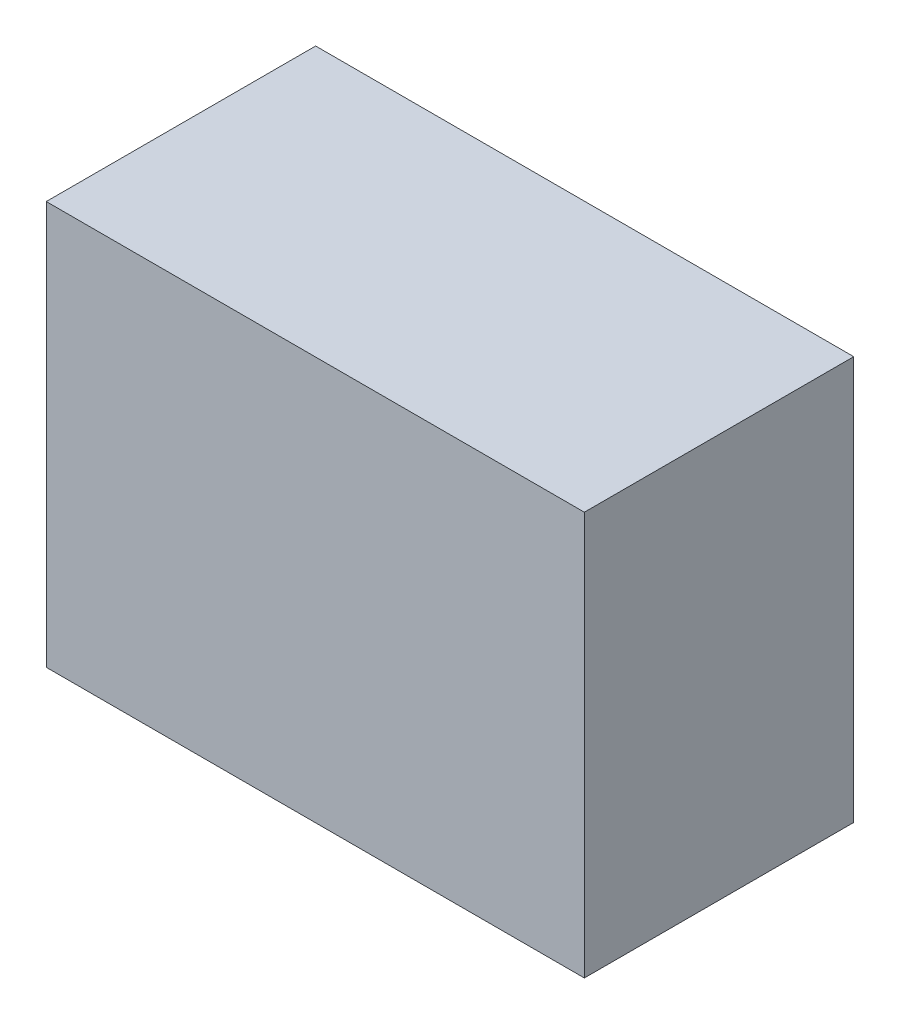
ISO-10303-21;
HEADER;
FILE_DESCRIPTION(('STEP AP214'),'2;1');
FILE_NAME('part.step','',(''),(''),'','','');
FILE_SCHEMA(('AUTOMOTIVE_DESIGN { 1 0 10303 214 1 1 1 1 }'));
ENDSEC;
DATA;
#1=APPLICATION_CONTEXT('core data for automotive mechanical design processes');
#2=APPLICATION_PROTOCOL_DEFINITION('international standard','automotive_design',2000,#1);
#3=PRODUCT_CONTEXT('',#1,'mechanical');
#4=PRODUCT('Part','Part','',(#3));
#5=PRODUCT_RELATED_PRODUCT_CATEGORY('part','',(#4));
#6=PRODUCT_DEFINITION_FORMATION('','',#4);
#7=PRODUCT_DEFINITION_CONTEXT('part definition',#1,'design');
#8=PRODUCT_DEFINITION('design','',#6,#7);
#9=PRODUCT_DEFINITION_SHAPE('','',#8);
#10=(LENGTH_UNIT() NAMED_UNIT(*) SI_UNIT(.MILLI.,.METRE.));
#11=(NAMED_UNIT(*) PLANE_ANGLE_UNIT() SI_UNIT($,.RADIAN.));
#12=(NAMED_UNIT(*) SI_UNIT($,.STERADIAN.) SOLID_ANGLE_UNIT());
#13=UNCERTAINTY_MEASURE_WITH_UNIT(LENGTH_MEASURE(1.E-05),#10,'distance_accuracy_value','');
#14=(GEOMETRIC_REPRESENTATION_CONTEXT(3) GLOBAL_UNCERTAINTY_ASSIGNED_CONTEXT((#13)) GLOBAL_UNIT_ASSIGNED_CONTEXT((#10,
#11,#12)) REPRESENTATION_CONTEXT('',''));
#15=CARTESIAN_POINT('',(0.,0.,0.));
#16=DIRECTION('',(0.,0.,1.));
#17=DIRECTION('',(1.,0.,0.));
#18=AXIS2_PLACEMENT_3D('',#15,#16,#17);
#19=CARTESIAN_POINT('',(199.898,0.,100.076));
#20=DIRECTION('',(0.,-1.,0.));
#21=DIRECTION('',(0.,0.,-1.));
#22=AXIS2_PLACEMENT_3D('',#19,#20,#21);
#23=PLANE('',#22);
#24=DIRECTION('',(-1.,0.,0.));
#25=VECTOR('',#24,1.);
#26=CARTESIAN_POINT('',(199.898,0.,0.));
#27=LINE('',#26,#25);
#28=CARTESIAN_POINT('',(199.898,0.,0.));
#29=VERTEX_POINT('',#28);
#30=CARTESIAN_POINT('',(0.,0.,0.));
#31=VERTEX_POINT('',#30);
#32=EDGE_CURVE('E67',#29,#31,#27,.T.);
#33=ORIENTED_EDGE('',*,*,#32,.F.);
#34=DIRECTION('',(0.,0.,-1.));
#35=VECTOR('',#34,1.);
#36=CARTESIAN_POINT('',(199.898,0.,100.076));
#37=LINE('',#36,#35);
#38=CARTESIAN_POINT('',(199.898,0.,100.076));
#39=VERTEX_POINT('',#38);
#40=EDGE_CURVE('E19',#39,#29,#37,.T.);
#41=ORIENTED_EDGE('',*,*,#40,.F.);
#42=DIRECTION('',(-1.,0.,0.));
#43=VECTOR('',#42,1.);
#44=CARTESIAN_POINT('',(199.898,0.,100.076));
#45=LINE('',#44,#43);
#46=CARTESIAN_POINT('',(0.,0.,100.076));
#47=VERTEX_POINT('',#46);
#48=EDGE_CURVE('E69',#39,#47,#45,.T.);
#49=ORIENTED_EDGE('',*,*,#48,.T.);
#50=DIRECTION('',(0.,0.,-1.));
#51=VECTOR('',#50,1.);
#52=CARTESIAN_POINT('',(0.,0.,100.076));
#53=LINE('',#52,#51);
#54=EDGE_CURVE('E11',#47,#31,#53,.T.);
#55=ORIENTED_EDGE('',*,*,#54,.T.);
#56=EDGE_LOOP('',(#33,#41,#49,#55));
#57=FACE_BOUND('',#56,.T.);
#58=ADVANCED_FACE('F16',(#57),#23,.T.);
#59=CARTESIAN_POINT('',(0.,0.,100.076));
#60=DIRECTION('',(-1.,0.,0.));
#61=DIRECTION('',(0.,0.,1.));
#62=AXIS2_PLACEMENT_3D('',#59,#60,#61);
#63=PLANE('',#62);
#64=DIRECTION('',(0.,1.,0.));
#65=VECTOR('',#64,1.);
#66=CARTESIAN_POINT('',(0.,0.,0.));
#67=LINE('',#66,#65);
#68=CARTESIAN_POINT('',(0.,149.86,0.));
#69=VERTEX_POINT('',#68);
#70=EDGE_CURVE('E72',#31,#69,#67,.T.);
#71=ORIENTED_EDGE('',*,*,#70,.F.);
#72=ORIENTED_EDGE('',*,*,#54,.F.);
#73=DIRECTION('',(0.,1.,0.));
#74=VECTOR('',#73,1.);
#75=CARTESIAN_POINT('',(0.,0.,100.076));
#76=LINE('',#75,#74);
#77=CARTESIAN_POINT('',(0.,149.86,100.076));
#78=VERTEX_POINT('',#77);
#79=EDGE_CURVE('E78',#47,#78,#76,.T.);
#80=ORIENTED_EDGE('',*,*,#79,.T.);
#81=DIRECTION('',(0.,0.,-1.));
#82=VECTOR('',#81,1.);
#83=CARTESIAN_POINT('',(0.,149.86,100.076));
#84=LINE('',#83,#82);
#85=EDGE_CURVE('E24',#78,#69,#84,.T.);
#86=ORIENTED_EDGE('',*,*,#85,.T.);
#87=EDGE_LOOP('',(#71,#72,#80,#86));
#88=FACE_BOUND('',#87,.T.);
#89=ADVANCED_FACE('F85',(#88),#63,.T.);
#90=CARTESIAN_POINT('',(0.,149.86,100.076));
#91=DIRECTION('',(0.,1.,0.));
#92=DIRECTION('',(0.,0.,1.));
#93=AXIS2_PLACEMENT_3D('',#90,#91,#92);
#94=PLANE('',#93);
#95=DIRECTION('',(1.,0.,0.));
#96=VECTOR('',#95,1.);
#97=CARTESIAN_POINT('',(0.,149.86,0.));
#98=LINE('',#97,#96);
#99=CARTESIAN_POINT('',(199.898,149.86,0.));
#100=VERTEX_POINT('',#99);
#101=EDGE_CURVE('E68',#69,#100,#98,.T.);
#102=ORIENTED_EDGE('',*,*,#101,.F.);
#103=ORIENTED_EDGE('',*,*,#85,.F.);
#104=DIRECTION('',(1.,0.,0.));
#105=VECTOR('',#104,1.);
#106=CARTESIAN_POINT('',(0.,149.86,100.076));
#107=LINE('',#106,#105);
#108=CARTESIAN_POINT('',(199.898,149.86,100.076));
#109=VERTEX_POINT('',#108);
#110=EDGE_CURVE('E80',#78,#109,#107,.T.);
#111=ORIENTED_EDGE('',*,*,#110,.T.);
#112=DIRECTION('',(0.,0.,-1.));
#113=VECTOR('',#112,1.);
#114=CARTESIAN_POINT('',(199.898,149.86,100.076));
#115=LINE('',#114,#113);
#116=EDGE_CURVE('E31',#109,#100,#115,.T.);
#117=ORIENTED_EDGE('',*,*,#116,.T.);
#118=EDGE_LOOP('',(#102,#103,#111,#117));
#119=FACE_BOUND('',#118,.T.);
#120=ADVANCED_FACE('F88',(#119),#94,.T.);
#121=CARTESIAN_POINT('',(199.898,149.86,100.076));
#122=DIRECTION('',(1.,0.,0.));
#123=DIRECTION('',(0.,0.,-1.));
#124=AXIS2_PLACEMENT_3D('',#121,#122,#123);
#125=PLANE('',#124);
#126=DIRECTION('',(0.,-1.,0.));
#127=VECTOR('',#126,1.);
#128=CARTESIAN_POINT('',(199.898,149.86,0.));
#129=LINE('',#128,#127);
#130=EDGE_CURVE('E55',#100,#29,#129,.T.);
#131=ORIENTED_EDGE('',*,*,#130,.F.);
#132=ORIENTED_EDGE('',*,*,#116,.F.);
#133=DIRECTION('',(0.,-1.,0.));
#134=VECTOR('',#133,1.);
#135=CARTESIAN_POINT('',(199.898,149.86,100.076));
#136=LINE('',#135,#134);
#137=EDGE_CURVE('E58',#109,#39,#136,.T.);
#138=ORIENTED_EDGE('',*,*,#137,.T.);
#139=ORIENTED_EDGE('',*,*,#40,.T.);
#140=EDGE_LOOP('',(#131,#132,#138,#139));
#141=FACE_BOUND('',#140,.T.);
#142=ADVANCED_FACE('F54',(#141),#125,.T.);
#143=CARTESIAN_POINT('',(0.,0.,100.076));
#144=DIRECTION('',(0.,0.,-1.));
#145=DIRECTION('',(-1.,0.,0.));
#146=AXIS2_PLACEMENT_3D('',#143,#144,#145);
#147=PLANE('',#146);
#148=ORIENTED_EDGE('',*,*,#48,.F.);
#149=ORIENTED_EDGE('',*,*,#137,.F.);
#150=ORIENTED_EDGE('',*,*,#110,.F.);
#151=ORIENTED_EDGE('',*,*,#79,.F.);
#152=EDGE_LOOP('',(#148,#149,#150,#151));
#153=FACE_BOUND('',#152,.T.);
#154=ADVANCED_FACE('F90',(#153),#147,.F.);
#155=CARTESIAN_POINT('',(0.,0.,0.));
#156=DIRECTION('',(0.,0.,-1.));
#157=DIRECTION('',(-1.,0.,0.));
#158=AXIS2_PLACEMENT_3D('',#155,#156,#157);
#159=PLANE('',#158);
#160=ORIENTED_EDGE('',*,*,#32,.T.);
#161=ORIENTED_EDGE('',*,*,#70,.T.);
#162=ORIENTED_EDGE('',*,*,#101,.T.);
#163=ORIENTED_EDGE('',*,*,#130,.T.);
#164=EDGE_LOOP('',(#160,#161,#162,#163));
#165=FACE_BOUND('',#164,.T.);
#166=ADVANCED_FACE('F65',(#165),#159,.T.);
#167=CLOSED_SHELL('',(#58,#89,#120,#142,#154,#166));
#168=MANIFOLD_SOLID_BREP('B1',#167);
#169=ADVANCED_BREP_SHAPE_REPRESENTATION('',(#18,#168),#14);
#170=SHAPE_DEFINITION_REPRESENTATION(#9,#169);
ENDSEC;
END-ISO-10303-21;
